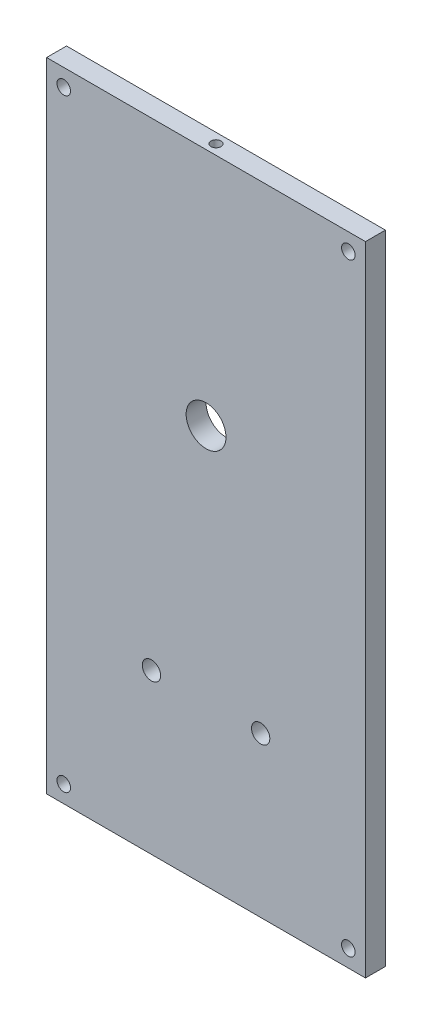
ISO-10303-21;
HEADER;
FILE_DESCRIPTION(('STEP AP214'),'2;1');
FILE_NAME('part.step','',(''),(''),'','','');
FILE_SCHEMA(('AUTOMOTIVE_DESIGN { 1 0 10303 214 1 1 1 1 }'));
ENDSEC;
DATA;
#1=APPLICATION_CONTEXT('core data for automotive mechanical design processes');
#2=APPLICATION_PROTOCOL_DEFINITION('international standard','automotive_design',2000,#1);
#3=PRODUCT_CONTEXT('',#1,'mechanical');
#4=PRODUCT('Part','Part','',(#3));
#5=PRODUCT_RELATED_PRODUCT_CATEGORY('part','',(#4));
#6=PRODUCT_DEFINITION_FORMATION('','',#4);
#7=PRODUCT_DEFINITION_CONTEXT('part definition',#1,'design');
#8=PRODUCT_DEFINITION('design','',#6,#7);
#9=PRODUCT_DEFINITION_SHAPE('','',#8);
#10=(LENGTH_UNIT() NAMED_UNIT(*) SI_UNIT(.MILLI.,.METRE.));
#11=(NAMED_UNIT(*) PLANE_ANGLE_UNIT() SI_UNIT($,.RADIAN.));
#12=(NAMED_UNIT(*) SI_UNIT($,.STERADIAN.) SOLID_ANGLE_UNIT());
#13=UNCERTAINTY_MEASURE_WITH_UNIT(LENGTH_MEASURE(1.E-05),#10,'distance_accuracy_value','');
#14=(GEOMETRIC_REPRESENTATION_CONTEXT(3) GLOBAL_UNCERTAINTY_ASSIGNED_CONTEXT((#13)) GLOBAL_UNIT_ASSIGNED_CONTEXT((#10,
#11,#12)) REPRESENTATION_CONTEXT('',''));
#15=CARTESIAN_POINT('',(0.,0.,0.));
#16=DIRECTION('',(0.,0.,1.));
#17=DIRECTION('',(1.,0.,0.));
#18=AXIS2_PLACEMENT_3D('',#15,#16,#17);
#19=CARTESIAN_POINT('',(0.,0.,3.175));
#20=DIRECTION('',(0.,0.,1.));
#21=DIRECTION('',(1.,0.,0.));
#22=AXIS2_PLACEMENT_3D('',#19,#20,#21);
#23=PLANE('',#22);
#24=CARTESIAN_POINT('',(-21.7444134646432,-40.0868098159509,3.175));
#25=DIRECTION('',(0.,0.,1.));
#26=DIRECTION('',(1.,0.,0.));
#27=AXIS2_PLACEMENT_3D('',#24,#25,#26);
#28=CIRCLE('',#27,1.4605);
#29=CARTESIAN_POINT('',(-20.2839134646432,-40.0868098159509,3.175));
#30=VERTEX_POINT('',#29);
#31=EDGE_CURVE('E160',#30,#30,#28,.T.);
#32=ORIENTED_EDGE('',*,*,#31,.F.);
#33=EDGE_LOOP('',(#32));
#34=FACE_BOUND('',#33,.T.);
#35=CARTESIAN_POINT('',(-39.1434134646432,-40.0868098159509,3.175));
#36=DIRECTION('',(0.,0.,1.));
#37=DIRECTION('',(1.,0.,0.));
#38=AXIS2_PLACEMENT_3D('',#35,#36,#37);
#39=CIRCLE('',#38,1.4605);
#40=CARTESIAN_POINT('',(-37.6829134646432,-40.0868098159509,3.175));
#41=VERTEX_POINT('',#40);
#42=EDGE_CURVE('E154',#41,#41,#39,.T.);
#43=ORIENTED_EDGE('',*,*,#42,.F.);
#44=EDGE_LOOP('',(#43));
#45=FACE_BOUND('',#44,.T.);
#46=CARTESIAN_POINT('',(-30.4439134646432,-1.98680981595091,3.175));
#47=DIRECTION('',(0.,0.,1.));
#48=DIRECTION('',(1.,0.,0.));
#49=AXIS2_PLACEMENT_3D('',#46,#47,#48);
#50=CIRCLE('',#49,3.175);
#51=CARTESIAN_POINT('',(-27.2689134646432,-1.98680981595091,3.175));
#52=VERTEX_POINT('',#51);
#53=EDGE_CURVE('E148',#52,#52,#50,.T.);
#54=ORIENTED_EDGE('',*,*,#53,.F.);
#55=EDGE_LOOP('',(#54));
#56=FACE_BOUND('',#55,.T.);
#57=CARTESIAN_POINT('',(-7.7744134646432,-62.7563098159509,3.175));
#58=DIRECTION('',(0.,0.,1.));
#59=DIRECTION('',(1.,0.,0.));
#60=AXIS2_PLACEMENT_3D('',#57,#58,#59);
#61=CIRCLE('',#60,1.0795);
#62=CARTESIAN_POINT('',(-6.6949134646432,-62.7563098159509,3.175));
#63=VERTEX_POINT('',#62);
#64=EDGE_CURVE('E121',#63,#63,#61,.T.);
#65=ORIENTED_EDGE('',*,*,#64,.F.);
#66=EDGE_LOOP('',(#65));
#67=FACE_BOUND('',#66,.T.);
#68=CARTESIAN_POINT('',(-53.1134134646432,33.3826901840491,3.175));
#69=DIRECTION('',(0.,0.,1.));
#70=DIRECTION('',(1.,0.,0.));
#71=AXIS2_PLACEMENT_3D('',#68,#69,#70);
#72=CIRCLE('',#71,1.0795);
#73=CARTESIAN_POINT('',(-52.0339134646432,33.3826901840491,3.175));
#74=VERTEX_POINT('',#73);
#75=EDGE_CURVE('E100',#74,#74,#72,.T.);
#76=ORIENTED_EDGE('',*,*,#75,.F.);
#77=EDGE_LOOP('',(#76));
#78=FACE_BOUND('',#77,.T.);
#79=DIRECTION('',(0.,-1.,0.));
#80=VECTOR('',#79,1.);
#81=CARTESIAN_POINT('',(-55.8439134646432,36.1131901840491,3.175));
#82=LINE('',#81,#80);
#83=CARTESIAN_POINT('',(-55.8439134646432,36.1131901840491,3.175));
#84=VERTEX_POINT('',#83);
#85=CARTESIAN_POINT('',(-55.8439134646432,-65.4868098159509,3.175));
#86=VERTEX_POINT('',#85);
#87=EDGE_CURVE('E85',#84,#86,#82,.T.);
#88=ORIENTED_EDGE('',*,*,#87,.T.);
#89=DIRECTION('',(1.,0.,0.));
#90=VECTOR('',#89,1.);
#91=CARTESIAN_POINT('',(-55.8439134646432,-65.4868098159509,3.175));
#92=LINE('',#91,#90);
#93=CARTESIAN_POINT('',(-5.0439134646432,-65.4868098159509,3.175));
#94=VERTEX_POINT('',#93);
#95=EDGE_CURVE('E80',#86,#94,#92,.T.);
#96=ORIENTED_EDGE('',*,*,#95,.T.);
#97=DIRECTION('',(0.,1.,0.));
#98=VECTOR('',#97,1.);
#99=CARTESIAN_POINT('',(-5.04391346464321,36.1131901840491,3.175));
#100=LINE('',#99,#98);
#101=CARTESIAN_POINT('',(-5.04391346464321,36.1131901840491,3.175));
#102=VERTEX_POINT('',#101);
#103=EDGE_CURVE('E83',#94,#102,#100,.T.);
#104=ORIENTED_EDGE('',*,*,#103,.T.);
#105=DIRECTION('',(-1.,0.,0.));
#106=VECTOR('',#105,1.);
#107=CARTESIAN_POINT('',(-55.8439134646432,36.1131901840491,3.175));
#108=LINE('',#107,#106);
#109=EDGE_CURVE('E50',#102,#84,#108,.T.);
#110=ORIENTED_EDGE('',*,*,#109,.T.);
#111=EDGE_LOOP('',(#88,#96,#104,#110));
#112=FACE_BOUND('',#111,.T.);
#113=CARTESIAN_POINT('',(-53.1134134646432,-62.7563098159509,3.175));
#114=DIRECTION('',(0.,0.,1.));
#115=DIRECTION('',(1.,0.,0.));
#116=AXIS2_PLACEMENT_3D('',#113,#114,#115);
#117=CIRCLE('',#116,1.0795);
#118=CARTESIAN_POINT('',(-52.0339134646432,-62.7563098159509,3.175));
#119=VERTEX_POINT('',#118);
#120=EDGE_CURVE('E115',#119,#119,#117,.T.);
#121=ORIENTED_EDGE('',*,*,#120,.F.);
#122=EDGE_LOOP('',(#121));
#123=FACE_BOUND('',#122,.T.);
#124=CARTESIAN_POINT('',(-7.77441346464321,33.3826901840491,3.175));
#125=DIRECTION('',(0.,0.,1.));
#126=DIRECTION('',(1.,0.,0.));
#127=AXIS2_PLACEMENT_3D('',#124,#125,#126);
#128=CIRCLE('',#127,1.0795);
#129=CARTESIAN_POINT('',(-6.69491346464321,33.3826901840491,3.175));
#130=VERTEX_POINT('',#129);
#131=EDGE_CURVE('E127',#130,#130,#128,.T.);
#132=ORIENTED_EDGE('',*,*,#131,.F.);
#133=EDGE_LOOP('',(#132));
#134=FACE_BOUND('',#133,.T.);
#135=ADVANCED_FACE('F33',(#34,#45,#56,#67,#78,#112,#123,#134),#23,.T.);
#136=CARTESIAN_POINT('',(0.,0.,0.));
#137=DIRECTION('',(0.,0.,1.));
#138=DIRECTION('',(1.,0.,0.));
#139=AXIS2_PLACEMENT_3D('',#136,#137,#138);
#140=PLANE('',#139);
#141=CARTESIAN_POINT('',(-21.7444134646432,-40.0868098159509,0.));
#142=DIRECTION('',(0.,0.,1.));
#143=DIRECTION('',(1.,0.,0.));
#144=AXIS2_PLACEMENT_3D('',#141,#142,#143);
#145=CIRCLE('',#144,1.4605);
#146=CARTESIAN_POINT('',(-20.2839134646432,-40.0868098159509,0.));
#147=VERTEX_POINT('',#146);
#148=EDGE_CURVE('E157',#147,#147,#145,.T.);
#149=ORIENTED_EDGE('',*,*,#148,.T.);
#150=EDGE_LOOP('',(#149));
#151=FACE_BOUND('',#150,.T.);
#152=CARTESIAN_POINT('',(-39.1434134646432,-40.0868098159509,0.));
#153=DIRECTION('',(0.,0.,1.));
#154=DIRECTION('',(1.,0.,0.));
#155=AXIS2_PLACEMENT_3D('',#152,#153,#154);
#156=CIRCLE('',#155,1.4605);
#157=CARTESIAN_POINT('',(-37.6829134646432,-40.0868098159509,0.));
#158=VERTEX_POINT('',#157);
#159=EDGE_CURVE('E151',#158,#158,#156,.T.);
#160=ORIENTED_EDGE('',*,*,#159,.T.);
#161=EDGE_LOOP('',(#160));
#162=FACE_BOUND('',#161,.T.);
#163=CARTESIAN_POINT('',(-30.4439134646432,-1.98680981595091,0.));
#164=DIRECTION('',(0.,0.,1.));
#165=DIRECTION('',(1.,0.,0.));
#166=AXIS2_PLACEMENT_3D('',#163,#164,#165);
#167=CIRCLE('',#166,3.175);
#168=CARTESIAN_POINT('',(-27.2689134646432,-1.98680981595091,0.));
#169=VERTEX_POINT('',#168);
#170=EDGE_CURVE('E145',#169,#169,#167,.T.);
#171=ORIENTED_EDGE('',*,*,#170,.T.);
#172=EDGE_LOOP('',(#171));
#173=FACE_BOUND('',#172,.T.);
#174=CARTESIAN_POINT('',(-7.7744134646432,-62.7563098159509,0.));
#175=DIRECTION('',(0.,0.,1.));
#176=DIRECTION('',(1.,0.,0.));
#177=AXIS2_PLACEMENT_3D('',#174,#175,#176);
#178=CIRCLE('',#177,1.0795);
#179=CARTESIAN_POINT('',(-6.6949134646432,-62.7563098159509,0.));
#180=VERTEX_POINT('',#179);
#181=EDGE_CURVE('E124',#180,#180,#178,.T.);
#182=ORIENTED_EDGE('',*,*,#181,.T.);
#183=EDGE_LOOP('',(#182));
#184=FACE_BOUND('',#183,.T.);
#185=CARTESIAN_POINT('',(-53.1134134646432,33.3826901840491,0.));
#186=DIRECTION('',(0.,0.,1.));
#187=DIRECTION('',(1.,0.,0.));
#188=AXIS2_PLACEMENT_3D('',#185,#186,#187);
#189=CIRCLE('',#188,1.0795);
#190=CARTESIAN_POINT('',(-52.0339134646432,33.3826901840491,0.));
#191=VERTEX_POINT('',#190);
#192=EDGE_CURVE('E112',#191,#191,#189,.T.);
#193=ORIENTED_EDGE('',*,*,#192,.T.);
#194=EDGE_LOOP('',(#193));
#195=FACE_BOUND('',#194,.T.);
#196=DIRECTION('',(0.,-1.,0.));
#197=VECTOR('',#196,1.);
#198=CARTESIAN_POINT('',(-55.8439134646432,36.1131901840491,0.));
#199=LINE('',#198,#197);
#200=CARTESIAN_POINT('',(-55.8439134646432,36.1131901840491,0.));
#201=VERTEX_POINT('',#200);
#202=CARTESIAN_POINT('',(-55.8439134646432,-65.4868098159509,0.));
#203=VERTEX_POINT('',#202);
#204=EDGE_CURVE('E97',#201,#203,#199,.T.);
#205=ORIENTED_EDGE('',*,*,#204,.F.);
#206=DIRECTION('',(-1.,0.,0.));
#207=VECTOR('',#206,1.);
#208=CARTESIAN_POINT('',(-55.8439134646432,36.1131901840491,0.));
#209=LINE('',#208,#207);
#210=CARTESIAN_POINT('',(-5.04391346464321,36.1131901840491,0.));
#211=VERTEX_POINT('',#210);
#212=EDGE_CURVE('E73',#211,#201,#209,.T.);
#213=ORIENTED_EDGE('',*,*,#212,.F.);
#214=DIRECTION('',(0.,1.,0.));
#215=VECTOR('',#214,1.);
#216=CARTESIAN_POINT('',(-5.04391346464321,36.1131901840491,0.));
#217=LINE('',#216,#215);
#218=CARTESIAN_POINT('',(-5.0439134646432,-65.4868098159509,0.));
#219=VERTEX_POINT('',#218);
#220=EDGE_CURVE('E67',#219,#211,#217,.T.);
#221=ORIENTED_EDGE('',*,*,#220,.F.);
#222=DIRECTION('',(1.,0.,0.));
#223=VECTOR('',#222,1.);
#224=CARTESIAN_POINT('',(-55.8439134646432,-65.4868098159509,0.));
#225=LINE('',#224,#223);
#226=EDGE_CURVE('E89',#203,#219,#225,.T.);
#227=ORIENTED_EDGE('',*,*,#226,.F.);
#228=EDGE_LOOP('',(#205,#213,#221,#227));
#229=FACE_BOUND('',#228,.T.);
#230=CARTESIAN_POINT('',(-53.1134134646432,-62.7563098159509,0.));
#231=DIRECTION('',(0.,0.,1.));
#232=DIRECTION('',(1.,0.,0.));
#233=AXIS2_PLACEMENT_3D('',#230,#231,#232);
#234=CIRCLE('',#233,1.0795);
#235=CARTESIAN_POINT('',(-52.0339134646432,-62.7563098159509,0.));
#236=VERTEX_POINT('',#235);
#237=EDGE_CURVE('E118',#236,#236,#234,.T.);
#238=ORIENTED_EDGE('',*,*,#237,.T.);
#239=EDGE_LOOP('',(#238));
#240=FACE_BOUND('',#239,.T.);
#241=CARTESIAN_POINT('',(-7.77441346464321,33.3826901840491,0.));
#242=DIRECTION('',(0.,0.,1.));
#243=DIRECTION('',(1.,0.,0.));
#244=AXIS2_PLACEMENT_3D('',#241,#242,#243);
#245=CIRCLE('',#244,1.0795);
#246=CARTESIAN_POINT('',(-6.69491346464321,33.3826901840491,0.));
#247=VERTEX_POINT('',#246);
#248=EDGE_CURVE('E130',#247,#247,#245,.T.);
#249=ORIENTED_EDGE('',*,*,#248,.T.);
#250=EDGE_LOOP('',(#249));
#251=FACE_BOUND('',#250,.T.);
#252=ADVANCED_FACE('F108',(#151,#162,#173,#184,#195,#229,#240,#251),#140,.F.);
#253=CARTESIAN_POINT('',(-55.8439134646432,36.1131901840491,3.175));
#254=DIRECTION('',(1.,0.,0.));
#255=DIRECTION('',(0.,1.,0.));
#256=AXIS2_PLACEMENT_3D('',#253,#254,#255);
#257=PLANE('',#256);
#258=ORIENTED_EDGE('',*,*,#204,.T.);
#259=DIRECTION('',(0.,0.,-1.));
#260=VECTOR('',#259,1.);
#261=CARTESIAN_POINT('',(-55.8439134646432,-65.4868098159509,3.175));
#262=LINE('',#261,#260);
#263=EDGE_CURVE('E11',#86,#203,#262,.T.);
#264=ORIENTED_EDGE('',*,*,#263,.F.);
#265=ORIENTED_EDGE('',*,*,#87,.F.);
#266=DIRECTION('',(0.,0.,-1.));
#267=VECTOR('',#266,1.);
#268=CARTESIAN_POINT('',(-55.8439134646432,36.1131901840491,3.175));
#269=LINE('',#268,#267);
#270=EDGE_CURVE('E93',#84,#201,#269,.T.);
#271=ORIENTED_EDGE('',*,*,#270,.T.);
#272=EDGE_LOOP('',(#258,#264,#265,#271));
#273=FACE_BOUND('',#272,.T.);
#274=ADVANCED_FACE('F35',(#273),#257,.F.);
#275=CARTESIAN_POINT('',(-55.8439134646432,-65.4868098159509,3.175));
#276=DIRECTION('',(0.,1.,0.));
#277=DIRECTION('',(0.,0.,1.));
#278=AXIS2_PLACEMENT_3D('',#275,#276,#277);
#279=PLANE('',#278);
#280=CARTESIAN_POINT('',(-30.4439134646432,-65.4868098159509,1.5875));
#281=DIRECTION('',(0.,-1.,0.));
#282=DIRECTION('',(0.,0.,-1.));
#283=AXIS2_PLACEMENT_3D('',#280,#281,#282);
#284=CIRCLE('',#283,0.793749999999999);
#285=CARTESIAN_POINT('',(-30.4439134646432,-65.4868098159509,0.793750000000001));
#286=VERTEX_POINT('',#285);
#287=EDGE_CURVE('E142',#286,#286,#284,.T.);
#288=ORIENTED_EDGE('',*,*,#287,.F.);
#289=EDGE_LOOP('',(#288));
#290=FACE_BOUND('',#289,.T.);
#291=ORIENTED_EDGE('',*,*,#226,.T.);
#292=DIRECTION('',(0.,0.,-1.));
#293=VECTOR('',#292,1.);
#294=CARTESIAN_POINT('',(-5.0439134646432,-65.4868098159509,3.175));
#295=LINE('',#294,#293);
#296=EDGE_CURVE('E42',#94,#219,#295,.T.);
#297=ORIENTED_EDGE('',*,*,#296,.F.);
#298=ORIENTED_EDGE('',*,*,#95,.F.);
#299=ORIENTED_EDGE('',*,*,#263,.T.);
#300=EDGE_LOOP('',(#291,#297,#298,#299));
#301=FACE_BOUND('',#300,.T.);
#302=ADVANCED_FACE('F88',(#290,#301),#279,.F.);
#303=CARTESIAN_POINT('',(-5.04391346464321,36.1131901840491,3.175));
#304=DIRECTION('',(-1.,0.,0.));
#305=DIRECTION('',(0.,-1.,0.));
#306=AXIS2_PLACEMENT_3D('',#303,#304,#305);
#307=PLANE('',#306);
#308=ORIENTED_EDGE('',*,*,#220,.T.);
#309=DIRECTION('',(0.,0.,-1.));
#310=VECTOR('',#309,1.);
#311=CARTESIAN_POINT('',(-5.04391346464321,36.1131901840491,3.175));
#312=LINE('',#311,#310);
#313=EDGE_CURVE('E90',#102,#211,#312,.T.);
#314=ORIENTED_EDGE('',*,*,#313,.F.);
#315=ORIENTED_EDGE('',*,*,#103,.F.);
#316=ORIENTED_EDGE('',*,*,#296,.T.);
#317=EDGE_LOOP('',(#308,#314,#315,#316));
#318=FACE_BOUND('',#317,.T.);
#319=ADVANCED_FACE('F91',(#318),#307,.F.);
#320=CARTESIAN_POINT('',(-55.8439134646432,36.1131901840491,3.175));
#321=DIRECTION('',(0.,-1.,0.));
#322=DIRECTION('',(0.,0.,-1.));
#323=AXIS2_PLACEMENT_3D('',#320,#321,#322);
#324=PLANE('',#323);
#325=CARTESIAN_POINT('',(-30.4439134646432,36.1131901840491,1.5875));
#326=DIRECTION('',(0.,1.,0.));
#327=DIRECTION('',(0.,0.,1.));
#328=AXIS2_PLACEMENT_3D('',#325,#326,#327);
#329=CIRCLE('',#328,0.793749999999999);
#330=CARTESIAN_POINT('',(-30.4439134646432,36.1131901840491,2.38125));
#331=VERTEX_POINT('',#330);
#332=EDGE_CURVE('E136',#331,#331,#329,.T.);
#333=ORIENTED_EDGE('',*,*,#332,.F.);
#334=EDGE_LOOP('',(#333));
#335=FACE_BOUND('',#334,.T.);
#336=ORIENTED_EDGE('',*,*,#212,.T.);
#337=ORIENTED_EDGE('',*,*,#270,.F.);
#338=ORIENTED_EDGE('',*,*,#109,.F.);
#339=ORIENTED_EDGE('',*,*,#313,.T.);
#340=EDGE_LOOP('',(#336,#337,#338,#339));
#341=FACE_BOUND('',#340,.T.);
#342=ADVANCED_FACE('F105',(#335,#341),#324,.F.);
#343=CARTESIAN_POINT('',(-53.1134134646432,33.3826901840491,3.175));
#344=DIRECTION('',(0.,0.,-1.));
#345=DIRECTION('',(-1.,0.,0.));
#346=AXIS2_PLACEMENT_3D('',#343,#344,#345);
#347=CYLINDRICAL_SURFACE('',#346,1.0795);
#348=ORIENTED_EDGE('',*,*,#75,.T.);
#349=EDGE_LOOP('',(#348));
#350=FACE_BOUND('',#349,.T.);
#351=ORIENTED_EDGE('',*,*,#192,.F.);
#352=EDGE_LOOP('',(#351));
#353=FACE_BOUND('',#352,.T.);
#354=ADVANCED_FACE('F186',(#350,#353),#347,.F.);
#355=CARTESIAN_POINT('',(-53.1134134646432,-62.7563098159509,3.175));
#356=DIRECTION('',(0.,0.,-1.));
#357=DIRECTION('',(-1.,0.,0.));
#358=AXIS2_PLACEMENT_3D('',#355,#356,#357);
#359=CYLINDRICAL_SURFACE('',#358,1.0795);
#360=ORIENTED_EDGE('',*,*,#120,.T.);
#361=EDGE_LOOP('',(#360));
#362=FACE_BOUND('',#361,.T.);
#363=ORIENTED_EDGE('',*,*,#237,.F.);
#364=EDGE_LOOP('',(#363));
#365=FACE_BOUND('',#364,.T.);
#366=ADVANCED_FACE('F189',(#362,#365),#359,.F.);
#367=CARTESIAN_POINT('',(-7.7744134646432,-62.7563098159509,3.175));
#368=DIRECTION('',(0.,0.,-1.));
#369=DIRECTION('',(-1.,0.,0.));
#370=AXIS2_PLACEMENT_3D('',#367,#368,#369);
#371=CYLINDRICAL_SURFACE('',#370,1.0795);
#372=ORIENTED_EDGE('',*,*,#64,.T.);
#373=EDGE_LOOP('',(#372));
#374=FACE_BOUND('',#373,.T.);
#375=ORIENTED_EDGE('',*,*,#181,.F.);
#376=EDGE_LOOP('',(#375));
#377=FACE_BOUND('',#376,.T.);
#378=ADVANCED_FACE('F234',(#374,#377),#371,.F.);
#379=CARTESIAN_POINT('',(-7.77441346464321,33.3826901840491,3.175));
#380=DIRECTION('',(0.,0.,-1.));
#381=DIRECTION('',(-1.,0.,0.));
#382=AXIS2_PLACEMENT_3D('',#379,#380,#381);
#383=CYLINDRICAL_SURFACE('',#382,1.0795);
#384=ORIENTED_EDGE('',*,*,#131,.T.);
#385=EDGE_LOOP('',(#384));
#386=FACE_BOUND('',#385,.T.);
#387=ORIENTED_EDGE('',*,*,#248,.F.);
#388=EDGE_LOOP('',(#387));
#389=FACE_BOUND('',#388,.T.);
#390=ADVANCED_FACE('F230',(#386,#389),#383,.F.);
#391=CARTESIAN_POINT('',(-30.4439134646432,29.7631901840491,1.5875));
#392=DIRECTION('',(0.,1.,0.));
#393=DIRECTION('',(0.,0.,1.));
#394=AXIS2_PLACEMENT_3D('',#391,#392,#393);
#395=CYLINDRICAL_SURFACE('',#394,0.793749999999999);
#396=CARTESIAN_POINT('',(-30.4439134646432,29.7631901840491,1.5875));
#397=DIRECTION('',(0.,1.,0.));
#398=DIRECTION('',(0.,0.,1.));
#399=AXIS2_PLACEMENT_3D('',#396,#397,#398);
#400=CIRCLE('',#399,0.793749999999999);
#401=CARTESIAN_POINT('',(-30.4439134646432,29.7631901840491,2.38125));
#402=VERTEX_POINT('',#401);
#403=EDGE_CURVE('E133',#402,#402,#400,.T.);
#404=ORIENTED_EDGE('',*,*,#403,.F.);
#405=EDGE_LOOP('',(#404));
#406=FACE_BOUND('',#405,.T.);
#407=ORIENTED_EDGE('',*,*,#332,.T.);
#408=EDGE_LOOP('',(#407));
#409=FACE_BOUND('',#408,.T.);
#410=ADVANCED_FACE('F222',(#406,#409),#395,.F.);
#411=CARTESIAN_POINT('',(-30.4439134646432,29.7631901840491,1.5875));
#412=DIRECTION('',(0.,1.,0.));
#413=DIRECTION('',(0.,0.,1.));
#414=AXIS2_PLACEMENT_3D('',#411,#412,#413);
#415=PLANE('',#414);
#416=ORIENTED_EDGE('',*,*,#403,.T.);
#417=EDGE_LOOP('',(#416));
#418=FACE_BOUND('',#417,.T.);
#419=ADVANCED_FACE('F212',(#418),#415,.T.);
#420=CARTESIAN_POINT('',(-30.4439134646432,-61.6768098159509,1.5875));
#421=DIRECTION('',(0.,-1.,0.));
#422=DIRECTION('',(0.,0.,-1.));
#423=AXIS2_PLACEMENT_3D('',#420,#421,#422);
#424=CYLINDRICAL_SURFACE('',#423,0.793749999999999);
#425=CARTESIAN_POINT('',(-30.4439134646432,-61.6768098159509,1.5875));
#426=DIRECTION('',(0.,-1.,0.));
#427=DIRECTION('',(0.,0.,-1.));
#428=AXIS2_PLACEMENT_3D('',#425,#426,#427);
#429=CIRCLE('',#428,0.793749999999999);
#430=CARTESIAN_POINT('',(-30.4439134646432,-61.6768098159509,0.793750000000001));
#431=VERTEX_POINT('',#430);
#432=EDGE_CURVE('E139',#431,#431,#429,.T.);
#433=ORIENTED_EDGE('',*,*,#432,.F.);
#434=EDGE_LOOP('',(#433));
#435=FACE_BOUND('',#434,.T.);
#436=ORIENTED_EDGE('',*,*,#287,.T.);
#437=EDGE_LOOP('',(#436));
#438=FACE_BOUND('',#437,.T.);
#439=ADVANCED_FACE('F209',(#435,#438),#424,.F.);
#440=CARTESIAN_POINT('',(-30.4439134646432,-61.6768098159509,1.5875));
#441=DIRECTION('',(0.,-1.,0.));
#442=DIRECTION('',(0.,0.,-1.));
#443=AXIS2_PLACEMENT_3D('',#440,#441,#442);
#444=PLANE('',#443);
#445=ORIENTED_EDGE('',*,*,#432,.T.);
#446=EDGE_LOOP('',(#445));
#447=FACE_BOUND('',#446,.T.);
#448=ADVANCED_FACE('F211',(#447),#444,.T.);
#449=CARTESIAN_POINT('',(-30.4439134646432,-1.98680981595091,0.));
#450=DIRECTION('',(0.,0.,1.));
#451=DIRECTION('',(1.,0.,0.));
#452=AXIS2_PLACEMENT_3D('',#449,#450,#451);
#453=CYLINDRICAL_SURFACE('',#452,3.175);
#454=ORIENTED_EDGE('',*,*,#170,.F.);
#455=EDGE_LOOP('',(#454));
#456=FACE_BOUND('',#455,.T.);
#457=ORIENTED_EDGE('',*,*,#53,.T.);
#458=EDGE_LOOP('',(#457));
#459=FACE_BOUND('',#458,.T.);
#460=ADVANCED_FACE('F219',(#456,#459),#453,.F.);
#461=CARTESIAN_POINT('',(-39.1434134646432,-40.0868098159509,0.));
#462=DIRECTION('',(0.,0.,1.));
#463=DIRECTION('',(1.,0.,0.));
#464=AXIS2_PLACEMENT_3D('',#461,#462,#463);
#465=CYLINDRICAL_SURFACE('',#464,1.4605);
#466=ORIENTED_EDGE('',*,*,#159,.F.);
#467=EDGE_LOOP('',(#466));
#468=FACE_BOUND('',#467,.T.);
#469=ORIENTED_EDGE('',*,*,#42,.T.);
#470=EDGE_LOOP('',(#469));
#471=FACE_BOUND('',#470,.T.);
#472=ADVANCED_FACE('F171',(#468,#471),#465,.F.);
#473=CARTESIAN_POINT('',(-21.7444134646432,-40.0868098159509,0.));
#474=DIRECTION('',(0.,0.,1.));
#475=DIRECTION('',(1.,0.,0.));
#476=AXIS2_PLACEMENT_3D('',#473,#474,#475);
#477=CYLINDRICAL_SURFACE('',#476,1.4605);
#478=ORIENTED_EDGE('',*,*,#148,.F.);
#479=EDGE_LOOP('',(#478));
#480=FACE_BOUND('',#479,.T.);
#481=ORIENTED_EDGE('',*,*,#31,.T.);
#482=EDGE_LOOP('',(#481));
#483=FACE_BOUND('',#482,.T.);
#484=ADVANCED_FACE('F168',(#480,#483),#477,.F.);
#485=CLOSED_SHELL('',(#135,#252,#274,#302,#319,#342,#354,#366,#378,#390,#410,#419,#439,#448,
#460,#472,#484));
#486=MANIFOLD_SOLID_BREP('B2',#485);
#487=ADVANCED_BREP_SHAPE_REPRESENTATION('',(#18,#486),#14);
#488=SHAPE_DEFINITION_REPRESENTATION(#9,#487);
ENDSEC;
END-ISO-10303-21;
